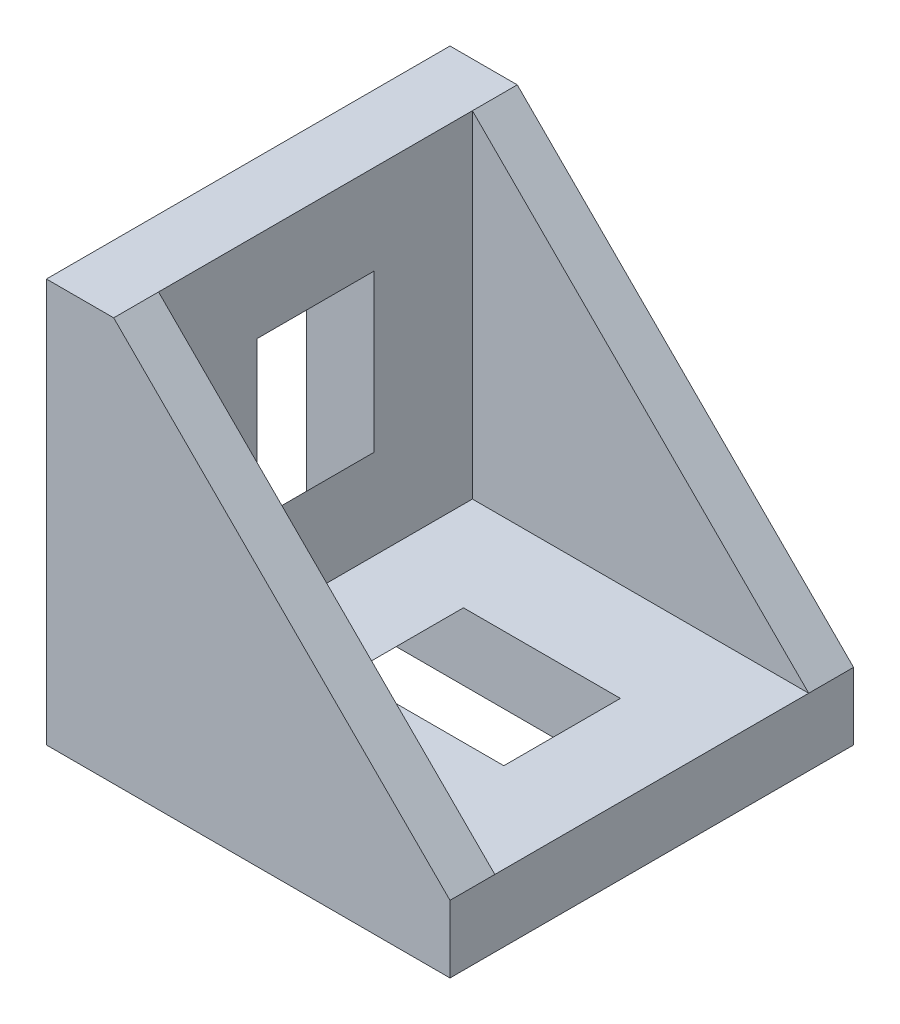
ISO-10303-21;
HEADER;
FILE_DESCRIPTION(('STEP AP214'),'2;1');
FILE_NAME('part.step','',(''),(''),'','','');
FILE_SCHEMA(('AUTOMOTIVE_DESIGN { 1 0 10303 214 1 1 1 1 }'));
ENDSEC;
DATA;
#1=APPLICATION_CONTEXT('core data for automotive mechanical design processes');
#2=APPLICATION_PROTOCOL_DEFINITION('international standard','automotive_design',2000,#1);
#3=PRODUCT_CONTEXT('',#1,'mechanical');
#4=PRODUCT('Part','Part','',(#3));
#5=PRODUCT_RELATED_PRODUCT_CATEGORY('part','',(#4));
#6=PRODUCT_DEFINITION_FORMATION('','',#4);
#7=PRODUCT_DEFINITION_CONTEXT('part definition',#1,'design');
#8=PRODUCT_DEFINITION('design','',#6,#7);
#9=PRODUCT_DEFINITION_SHAPE('','',#8);
#10=(LENGTH_UNIT() NAMED_UNIT(*) SI_UNIT(.MILLI.,.METRE.));
#11=(NAMED_UNIT(*) PLANE_ANGLE_UNIT() SI_UNIT($,.RADIAN.));
#12=(NAMED_UNIT(*) SI_UNIT($,.STERADIAN.) SOLID_ANGLE_UNIT());
#13=UNCERTAINTY_MEASURE_WITH_UNIT(LENGTH_MEASURE(1.E-05),#10,'distance_accuracy_value','');
#14=(GEOMETRIC_REPRESENTATION_CONTEXT(3) GLOBAL_UNCERTAINTY_ASSIGNED_CONTEXT((#13)) GLOBAL_UNIT_ASSIGNED_CONTEXT((#10,
#11,#12)) REPRESENTATION_CONTEXT('',''));
#15=CARTESIAN_POINT('',(0.,0.,0.));
#16=DIRECTION('',(0.,0.,1.));
#17=DIRECTION('',(1.,0.,0.));
#18=AXIS2_PLACEMENT_3D('',#15,#16,#17);
#19=CARTESIAN_POINT('',(0.,0.,9.));
#20=DIRECTION('',(1.,0.,0.));
#21=DIRECTION('',(0.,0.,-1.));
#22=AXIS2_PLACEMENT_3D('',#19,#20,#21);
#23=PLANE('',#22);
#24=DIRECTION('',(0.,0.,-1.));
#25=VECTOR('',#24,1.);
#26=CARTESIAN_POINT('',(0.,17.3,3.));
#27=LINE('',#26,#25);
#28=CARTESIAN_POINT('',(0.,17.3,3.));
#29=VERTEX_POINT('',#28);
#30=CARTESIAN_POINT('',(0.,17.3,-3.));
#31=VERTEX_POINT('',#30);
#32=EDGE_CURVE('E290',#29,#31,#27,.T.);
#33=ORIENTED_EDGE('',*,*,#32,.F.);
#34=DIRECTION('',(0.,1.,0.));
#35=VECTOR('',#34,1.);
#36=CARTESIAN_POINT('',(0.,17.3,3.));
#37=LINE('',#36,#35);
#38=CARTESIAN_POINT('',(0.,14.9992165715514,3.));
#39=VERTEX_POINT('',#38);
#40=EDGE_CURVE('E287',#39,#29,#37,.T.);
#41=ORIENTED_EDGE('',*,*,#40,.F.);
#42=DIRECTION('',(0.,0.,-1.));
#43=VECTOR('',#42,1.);
#44=CARTESIAN_POINT('',(0.,14.9992165715514,3.));
#45=LINE('',#44,#43);
#46=CARTESIAN_POINT('',(0.,14.9992165715514,-3.));
#47=VERTEX_POINT('',#46);
#48=EDGE_CURVE('E301',#39,#47,#45,.T.);
#49=ORIENTED_EDGE('',*,*,#48,.T.);
#50=DIRECTION('',(0.,1.,0.));
#51=VECTOR('',#50,1.);
#52=CARTESIAN_POINT('',(0.,17.3,-3.));
#53=LINE('',#52,#51);
#54=EDGE_CURVE('E282',#47,#31,#53,.T.);
#55=ORIENTED_EDGE('',*,*,#54,.T.);
#56=EDGE_LOOP('',(#33,#41,#49,#55));
#57=FACE_BOUND('',#56,.T.);
#58=DIRECTION('',(0.,-1.,0.));
#59=VECTOR('',#58,1.);
#60=CARTESIAN_POINT('',(0.,14.,-2.6));
#61=LINE('',#60,#59);
#62=CARTESIAN_POINT('',(0.,14.,-2.6));
#63=VERTEX_POINT('',#62);
#64=CARTESIAN_POINT('',(0.,4.,-2.6));
#65=VERTEX_POINT('',#64);
#66=EDGE_CURVE('E404',#63,#65,#61,.T.);
#67=ORIENTED_EDGE('',*,*,#66,.F.);
#68=DIRECTION('',(0.,0.,1.));
#69=VECTOR('',#68,1.);
#70=CARTESIAN_POINT('',(0.,14.,-2.6));
#71=LINE('',#70,#69);
#72=CARTESIAN_POINT('',(0.,14.,2.6));
#73=VERTEX_POINT('',#72);
#74=EDGE_CURVE('E427',#63,#73,#71,.T.);
#75=ORIENTED_EDGE('',*,*,#74,.T.);
#76=DIRECTION('',(0.,-1.,0.));
#77=VECTOR('',#76,1.);
#78=CARTESIAN_POINT('',(0.,14.,2.6));
#79=LINE('',#78,#77);
#80=CARTESIAN_POINT('',(0.,4.,2.6));
#81=VERTEX_POINT('',#80);
#82=EDGE_CURVE('E395',#73,#81,#79,.T.);
#83=ORIENTED_EDGE('',*,*,#82,.T.);
#84=DIRECTION('',(0.,0.,1.));
#85=VECTOR('',#84,1.);
#86=CARTESIAN_POINT('',(0.,4.,-2.6));
#87=LINE('',#86,#85);
#88=EDGE_CURVE('E416',#65,#81,#87,.T.);
#89=ORIENTED_EDGE('',*,*,#88,.F.);
#90=EDGE_LOOP('',(#67,#75,#83,#89));
#91=FACE_BOUND('',#90,.T.);
#92=DIRECTION('',(0.,-1.,0.));
#93=VECTOR('',#92,1.);
#94=CARTESIAN_POINT('',(0.,0.,-9.));
#95=LINE('',#94,#93);
#96=CARTESIAN_POINT('',(0.,18.,-9.));
#97=VERTEX_POINT('',#96);
#98=CARTESIAN_POINT('',(0.,0.,-9.));
#99=VERTEX_POINT('',#98);
#100=EDGE_CURVE('E467',#97,#99,#95,.T.);
#101=ORIENTED_EDGE('',*,*,#100,.T.);
#102=DIRECTION('',(0.,0.,-1.));
#103=VECTOR('',#102,1.);
#104=CARTESIAN_POINT('',(0.,0.,9.));
#105=LINE('',#104,#103);
#106=CARTESIAN_POINT('',(0.,0.,9.));
#107=VERTEX_POINT('',#106);
#108=EDGE_CURVE('E475',#107,#99,#105,.T.);
#109=ORIENTED_EDGE('',*,*,#108,.F.);
#110=DIRECTION('',(0.,-1.,0.));
#111=VECTOR('',#110,1.);
#112=CARTESIAN_POINT('',(0.,0.,9.));
#113=LINE('',#112,#111);
#114=CARTESIAN_POINT('',(0.,18.,9.));
#115=VERTEX_POINT('',#114);
#116=EDGE_CURVE('E473',#115,#107,#113,.T.);
#117=ORIENTED_EDGE('',*,*,#116,.F.);
#118=DIRECTION('',(0.,0.,-1.));
#119=VECTOR('',#118,1.);
#120=CARTESIAN_POINT('',(0.,18.,9.));
#121=LINE('',#120,#119);
#122=EDGE_CURVE('E489',#115,#97,#121,.T.);
#123=ORIENTED_EDGE('',*,*,#122,.T.);
#124=EDGE_LOOP('',(#101,#109,#117,#123));
#125=FACE_BOUND('',#124,.T.);
#126=DIRECTION('',(0.,1.,0.));
#127=VECTOR('',#126,1.);
#128=CARTESIAN_POINT('',(0.,1.23475047748415,3.));
#129=LINE('',#128,#127);
#130=CARTESIAN_POINT('',(0.,1.23475047748415,3.));
#131=VERTEX_POINT('',#130);
#132=CARTESIAN_POINT('',(0.,3.53553390593273,3.));
#133=VERTEX_POINT('',#132);
#134=EDGE_CURVE('E310',#131,#133,#129,.T.);
#135=ORIENTED_EDGE('',*,*,#134,.F.);
#136=DIRECTION('',(0.,0.,-1.));
#137=VECTOR('',#136,1.);
#138=CARTESIAN_POINT('',(0.,1.23475047748415,3.));
#139=LINE('',#138,#137);
#140=CARTESIAN_POINT('',(0.,1.23475047748415,-3.));
#141=VERTEX_POINT('',#140);
#142=EDGE_CURVE('E320',#131,#141,#139,.T.);
#143=ORIENTED_EDGE('',*,*,#142,.T.);
#144=DIRECTION('',(0.,1.,0.));
#145=VECTOR('',#144,1.);
#146=CARTESIAN_POINT('',(0.,1.23475047748415,-3.));
#147=LINE('',#146,#145);
#148=CARTESIAN_POINT('',(0.,3.53553390593273,-3.));
#149=VERTEX_POINT('',#148);
#150=EDGE_CURVE('E309',#141,#149,#147,.T.);
#151=ORIENTED_EDGE('',*,*,#150,.T.);
#152=DIRECTION('',(0.,0.,-1.));
#153=VECTOR('',#152,1.);
#154=CARTESIAN_POINT('',(0.,3.53553390593273,3.));
#155=LINE('',#154,#153);
#156=EDGE_CURVE('E336',#133,#149,#155,.T.);
#157=ORIENTED_EDGE('',*,*,#156,.F.);
#158=EDGE_LOOP('',(#135,#143,#151,#157));
#159=FACE_BOUND('',#158,.T.);
#160=ADVANCED_FACE('F34',(#57,#91,#125,#159),#23,.F.);
#161=CARTESIAN_POINT('',(18.,0.,9.));
#162=DIRECTION('',(0.,1.,0.));
#163=DIRECTION('',(-1.,0.,0.));
#164=AXIS2_PLACEMENT_3D('',#161,#162,#163);
#165=PLANE('',#164);
#166=DIRECTION('',(0.,0.,-1.));
#167=VECTOR('',#166,1.);
#168=CARTESIAN_POINT('',(14.9992165715514,0.,3.));
#169=LINE('',#168,#167);
#170=CARTESIAN_POINT('',(14.9992165715514,0.,3.));
#171=VERTEX_POINT('',#170);
#172=CARTESIAN_POINT('',(14.9992165715514,0.,-3.));
#173=VERTEX_POINT('',#172);
#174=EDGE_CURVE('E49',#171,#173,#169,.T.);
#175=ORIENTED_EDGE('',*,*,#174,.F.);
#176=DIRECTION('',(-1.,0.,0.));
#177=VECTOR('',#176,1.);
#178=CARTESIAN_POINT('',(17.3,0.,3.));
#179=LINE('',#178,#177);
#180=CARTESIAN_POINT('',(17.3,0.,3.));
#181=VERTEX_POINT('',#180);
#182=EDGE_CURVE('E54',#181,#171,#179,.T.);
#183=ORIENTED_EDGE('',*,*,#182,.F.);
#184=DIRECTION('',(0.,0.,-1.));
#185=VECTOR('',#184,1.);
#186=CARTESIAN_POINT('',(17.3,0.,3.));
#187=LINE('',#186,#185);
#188=CARTESIAN_POINT('',(17.3,0.,-3.));
#189=VERTEX_POINT('',#188);
#190=EDGE_CURVE('E262',#181,#189,#187,.T.);
#191=ORIENTED_EDGE('',*,*,#190,.T.);
#192=DIRECTION('',(-1.,0.,0.));
#193=VECTOR('',#192,1.);
#194=CARTESIAN_POINT('',(17.3,0.,-3.));
#195=LINE('',#194,#193);
#196=EDGE_CURVE('E266',#189,#173,#195,.T.);
#197=ORIENTED_EDGE('',*,*,#196,.T.);
#198=EDGE_LOOP('',(#175,#183,#191,#197));
#199=FACE_BOUND('',#198,.T.);
#200=DIRECTION('',(1.,0.,0.));
#201=VECTOR('',#200,1.);
#202=CARTESIAN_POINT('',(4.,0.,-2.6));
#203=LINE('',#202,#201);
#204=CARTESIAN_POINT('',(4.,0.,-2.6));
#205=VERTEX_POINT('',#204);
#206=CARTESIAN_POINT('',(14.,0.,-2.6));
#207=VERTEX_POINT('',#206);
#208=EDGE_CURVE('E372',#205,#207,#203,.T.);
#209=ORIENTED_EDGE('',*,*,#208,.F.);
#210=DIRECTION('',(0.,0.,1.));
#211=VECTOR('',#210,1.);
#212=CARTESIAN_POINT('',(4.,0.,-2.6));
#213=LINE('',#212,#211);
#214=CARTESIAN_POINT('',(4.,0.,2.6));
#215=VERTEX_POINT('',#214);
#216=EDGE_CURVE('E382',#205,#215,#213,.T.);
#217=ORIENTED_EDGE('',*,*,#216,.T.);
#218=DIRECTION('',(1.,0.,0.));
#219=VECTOR('',#218,1.);
#220=CARTESIAN_POINT('',(4.,0.,2.6));
#221=LINE('',#220,#219);
#222=CARTESIAN_POINT('',(14.,0.,2.6));
#223=VERTEX_POINT('',#222);
#224=EDGE_CURVE('E385',#215,#223,#221,.T.);
#225=ORIENTED_EDGE('',*,*,#224,.T.);
#226=DIRECTION('',(0.,0.,1.));
#227=VECTOR('',#226,1.);
#228=CARTESIAN_POINT('',(14.,0.,-2.6));
#229=LINE('',#228,#227);
#230=EDGE_CURVE('E399',#207,#223,#229,.T.);
#231=ORIENTED_EDGE('',*,*,#230,.F.);
#232=EDGE_LOOP('',(#209,#217,#225,#231));
#233=FACE_BOUND('',#232,.T.);
#234=DIRECTION('',(1.,0.,0.));
#235=VECTOR('',#234,1.);
#236=CARTESIAN_POINT('',(18.,0.,-9.));
#237=LINE('',#236,#235);
#238=CARTESIAN_POINT('',(18.,0.,-9.));
#239=VERTEX_POINT('',#238);
#240=EDGE_CURVE('E459',#99,#239,#237,.T.);
#241=ORIENTED_EDGE('',*,*,#240,.T.);
#242=DIRECTION('',(0.,0.,-1.));
#243=VECTOR('',#242,1.);
#244=CARTESIAN_POINT('',(18.,0.,9.));
#245=LINE('',#244,#243);
#246=CARTESIAN_POINT('',(18.,0.,9.));
#247=VERTEX_POINT('',#246);
#248=EDGE_CURVE('E11',#247,#239,#245,.T.);
#249=ORIENTED_EDGE('',*,*,#248,.F.);
#250=DIRECTION('',(1.,0.,0.));
#251=VECTOR('',#250,1.);
#252=CARTESIAN_POINT('',(18.,0.,9.));
#253=LINE('',#252,#251);
#254=EDGE_CURVE('E463',#107,#247,#253,.T.);
#255=ORIENTED_EDGE('',*,*,#254,.F.);
#256=ORIENTED_EDGE('',*,*,#108,.T.);
#257=EDGE_LOOP('',(#241,#249,#255,#256));
#258=FACE_BOUND('',#257,.T.);
#259=DIRECTION('',(-1.,0.,0.));
#260=VECTOR('',#259,1.);
#261=CARTESIAN_POINT('',(1.23475047748409,0.,3.));
#262=LINE('',#261,#260);
#263=CARTESIAN_POINT('',(3.53553390593274,0.,3.));
#264=VERTEX_POINT('',#263);
#265=CARTESIAN_POINT('',(1.23475047748409,0.,3.));
#266=VERTEX_POINT('',#265);
#267=EDGE_CURVE('E341',#264,#266,#262,.T.);
#268=ORIENTED_EDGE('',*,*,#267,.F.);
#269=DIRECTION('',(0.,0.,-1.));
#270=VECTOR('',#269,1.);
#271=CARTESIAN_POINT('',(3.53553390593274,0.,3.));
#272=LINE('',#271,#270);
#273=CARTESIAN_POINT('',(3.53553390593274,0.,-3.));
#274=VERTEX_POINT('',#273);
#275=EDGE_CURVE('E365',#264,#274,#272,.T.);
#276=ORIENTED_EDGE('',*,*,#275,.T.);
#277=DIRECTION('',(-1.,0.,0.));
#278=VECTOR('',#277,1.);
#279=CARTESIAN_POINT('',(1.23475047748409,0.,-3.));
#280=LINE('',#279,#278);
#281=CARTESIAN_POINT('',(1.23475047748409,0.,-3.));
#282=VERTEX_POINT('',#281);
#283=EDGE_CURVE('E351',#274,#282,#280,.T.);
#284=ORIENTED_EDGE('',*,*,#283,.T.);
#285=DIRECTION('',(0.,0.,-1.));
#286=VECTOR('',#285,1.);
#287=CARTESIAN_POINT('',(1.23475047748409,0.,3.));
#288=LINE('',#287,#286);
#289=EDGE_CURVE('E362',#266,#282,#288,.T.);
#290=ORIENTED_EDGE('',*,*,#289,.F.);
#291=EDGE_LOOP('',(#268,#276,#284,#290));
#292=FACE_BOUND('',#291,.T.);
#293=ADVANCED_FACE('F36',(#199,#233,#258,#292),#165,.F.);
#294=CARTESIAN_POINT('',(3.,3.,-7.));
#295=DIRECTION('',(0.,-1.,0.));
#296=DIRECTION('',(0.,0.,-1.));
#297=AXIS2_PLACEMENT_3D('',#294,#295,#296);
#298=PLANE('',#297);
#299=DIRECTION('',(1.,0.,0.));
#300=VECTOR('',#299,1.);
#301=CARTESIAN_POINT('',(3.,3.,7.));
#302=LINE('',#301,#300);
#303=CARTESIAN_POINT('',(3.,3.,7.));
#304=VERTEX_POINT('',#303);
#305=CARTESIAN_POINT('',(18.,3.,7.));
#306=VERTEX_POINT('',#305);
#307=EDGE_CURVE('E442',#304,#306,#302,.T.);
#308=ORIENTED_EDGE('',*,*,#307,.T.);
#309=DIRECTION('',(0.,0.,1.));
#310=VECTOR('',#309,1.);
#311=CARTESIAN_POINT('',(18.,3.,-7.));
#312=LINE('',#311,#310);
#313=CARTESIAN_POINT('',(18.,3.,-7.));
#314=VERTEX_POINT('',#313);
#315=EDGE_CURVE('E456',#314,#306,#312,.T.);
#316=ORIENTED_EDGE('',*,*,#315,.F.);
#317=DIRECTION('',(1.,0.,0.));
#318=VECTOR('',#317,1.);
#319=CARTESIAN_POINT('',(3.,3.,-7.));
#320=LINE('',#319,#318);
#321=CARTESIAN_POINT('',(3.,3.,-7.));
#322=VERTEX_POINT('',#321);
#323=EDGE_CURVE('E445',#322,#314,#320,.T.);
#324=ORIENTED_EDGE('',*,*,#323,.F.);
#325=DIRECTION('',(0.,0.,1.));
#326=VECTOR('',#325,1.);
#327=CARTESIAN_POINT('',(3.,3.,-7.));
#328=LINE('',#327,#326);
#329=EDGE_CURVE('E460',#322,#304,#328,.T.);
#330=ORIENTED_EDGE('',*,*,#329,.T.);
#331=EDGE_LOOP('',(#308,#316,#324,#330));
#332=FACE_BOUND('',#331,.T.);
#333=DIRECTION('',(-1.,0.,0.));
#334=VECTOR('',#333,1.);
#335=CARTESIAN_POINT('',(7.,3.,-2.6));
#336=LINE('',#335,#334);
#337=CARTESIAN_POINT('',(14.,3.,-2.6));
#338=VERTEX_POINT('',#337);
#339=CARTESIAN_POINT('',(7.,3.,-2.6));
#340=VERTEX_POINT('',#339);
#341=EDGE_CURVE('E379',#338,#340,#336,.T.);
#342=ORIENTED_EDGE('',*,*,#341,.F.);
#343=DIRECTION('',(0.,0.,1.));
#344=VECTOR('',#343,1.);
#345=CARTESIAN_POINT('',(14.,3.,-2.6));
#346=LINE('',#345,#344);
#347=CARTESIAN_POINT('',(14.,3.,2.6));
#348=VERTEX_POINT('',#347);
#349=EDGE_CURVE('E396',#338,#348,#346,.T.);
#350=ORIENTED_EDGE('',*,*,#349,.T.);
#351=DIRECTION('',(-1.,0.,0.));
#352=VECTOR('',#351,1.);
#353=CARTESIAN_POINT('',(7.,3.,2.6));
#354=LINE('',#353,#352);
#355=CARTESIAN_POINT('',(7.,3.,2.6));
#356=VERTEX_POINT('',#355);
#357=EDGE_CURVE('E373',#348,#356,#354,.T.);
#358=ORIENTED_EDGE('',*,*,#357,.T.);
#359=DIRECTION('',(0.,0.,1.));
#360=VECTOR('',#359,1.);
#361=CARTESIAN_POINT('',(7.,3.,-2.6));
#362=LINE('',#361,#360);
#363=EDGE_CURVE('E392',#340,#356,#362,.T.);
#364=ORIENTED_EDGE('',*,*,#363,.F.);
#365=EDGE_LOOP('',(#342,#350,#358,#364));
#366=FACE_BOUND('',#365,.T.);
#367=ADVANCED_FACE('F533',(#332,#366),#298,.F.);
#368=CARTESIAN_POINT('',(3.,18.,-7.));
#369=DIRECTION('',(-1.,0.,0.));
#370=DIRECTION('',(0.,-1.,0.));
#371=AXIS2_PLACEMENT_3D('',#368,#369,#370);
#372=PLANE('',#371);
#373=DIRECTION('',(0.,-1.,0.));
#374=VECTOR('',#373,1.);
#375=CARTESIAN_POINT('',(3.,18.,7.));
#376=LINE('',#375,#374);
#377=CARTESIAN_POINT('',(3.,18.,7.));
#378=VERTEX_POINT('',#377);
#379=EDGE_CURVE('E451',#378,#304,#376,.T.);
#380=ORIENTED_EDGE('',*,*,#379,.T.);
#381=ORIENTED_EDGE('',*,*,#329,.F.);
#382=DIRECTION('',(0.,-1.,0.));
#383=VECTOR('',#382,1.);
#384=CARTESIAN_POINT('',(3.,18.,-7.));
#385=LINE('',#384,#383);
#386=CARTESIAN_POINT('',(3.,18.,-7.));
#387=VERTEX_POINT('',#386);
#388=EDGE_CURVE('E441',#387,#322,#385,.T.);
#389=ORIENTED_EDGE('',*,*,#388,.F.);
#390=DIRECTION('',(0.,0.,1.));
#391=VECTOR('',#390,1.);
#392=CARTESIAN_POINT('',(3.,18.,-7.));
#393=LINE('',#392,#391);
#394=EDGE_CURVE('E448',#387,#378,#393,.T.);
#395=ORIENTED_EDGE('',*,*,#394,.T.);
#396=EDGE_LOOP('',(#380,#381,#389,#395));
#397=FACE_BOUND('',#396,.T.);
#398=DIRECTION('',(0.,1.,0.));
#399=VECTOR('',#398,1.);
#400=CARTESIAN_POINT('',(3.,14.,-2.6));
#401=LINE('',#400,#399);
#402=CARTESIAN_POINT('',(3.,7.,-2.6));
#403=VERTEX_POINT('',#402);
#404=CARTESIAN_POINT('',(3.,14.,-2.6));
#405=VERTEX_POINT('',#404);
#406=EDGE_CURVE('E411',#403,#405,#401,.T.);
#407=ORIENTED_EDGE('',*,*,#406,.F.);
#408=DIRECTION('',(0.,0.,1.));
#409=VECTOR('',#408,1.);
#410=CARTESIAN_POINT('',(3.,7.,-2.6));
#411=LINE('',#410,#409);
#412=CARTESIAN_POINT('',(3.,7.,2.6));
#413=VERTEX_POINT('',#412);
#414=EDGE_CURVE('E434',#403,#413,#411,.T.);
#415=ORIENTED_EDGE('',*,*,#414,.T.);
#416=DIRECTION('',(0.,1.,0.));
#417=VECTOR('',#416,1.);
#418=CARTESIAN_POINT('',(3.,14.,2.6));
#419=LINE('',#418,#417);
#420=CARTESIAN_POINT('',(3.,14.,2.6));
#421=VERTEX_POINT('',#420);
#422=EDGE_CURVE('E422',#413,#421,#419,.T.);
#423=ORIENTED_EDGE('',*,*,#422,.T.);
#424=DIRECTION('',(0.,0.,1.));
#425=VECTOR('',#424,1.);
#426=CARTESIAN_POINT('',(3.,14.,-2.6));
#427=LINE('',#426,#425);
#428=EDGE_CURVE('E431',#405,#421,#427,.T.);
#429=ORIENTED_EDGE('',*,*,#428,.F.);
#430=EDGE_LOOP('',(#407,#415,#423,#429));
#431=FACE_BOUND('',#430,.T.);
#432=ADVANCED_FACE('F538',(#397,#431),#372,.F.);
#433=CARTESIAN_POINT('',(18.,3.,9.));
#434=DIRECTION('',(-0.707106781186547,-0.707106781186547,0.));
#435=DIRECTION('',(0.707106781186548,-0.707106781186548,0.));
#436=AXIS2_PLACEMENT_3D('',#433,#434,#435);
#437=PLANE('',#436);
#438=DIRECTION('',(-0.707106781186547,0.707106781186547,0.));
#439=VECTOR('',#438,1.);
#440=CARTESIAN_POINT('',(3.,18.,-7.));
#441=LINE('',#440,#439);
#442=EDGE_CURVE('E439',#314,#387,#441,.T.);
#443=ORIENTED_EDGE('',*,*,#442,.F.);
#444=DIRECTION('',(0.,0.,-1.));
#445=VECTOR('',#444,1.);
#446=CARTESIAN_POINT('',(18.,3.,9.));
#447=LINE('',#446,#445);
#448=CARTESIAN_POINT('',(18.,3.,-9.));
#449=VERTEX_POINT('',#448);
#450=EDGE_CURVE('E495',#314,#449,#447,.T.);
#451=ORIENTED_EDGE('',*,*,#450,.T.);
#452=DIRECTION('',(-0.707106781186547,0.707106781186547,0.));
#453=VECTOR('',#452,1.);
#454=CARTESIAN_POINT('',(18.,3.,-9.));
#455=LINE('',#454,#453);
#456=CARTESIAN_POINT('',(3.,18.,-9.));
#457=VERTEX_POINT('',#456);
#458=EDGE_CURVE('E481',#449,#457,#455,.T.);
#459=ORIENTED_EDGE('',*,*,#458,.T.);
#460=DIRECTION('',(0.,0.,-1.));
#461=VECTOR('',#460,1.);
#462=CARTESIAN_POINT('',(3.,18.,9.));
#463=LINE('',#462,#461);
#464=EDGE_CURVE('E492',#387,#457,#463,.T.);
#465=ORIENTED_EDGE('',*,*,#464,.F.);
#466=EDGE_LOOP('',(#443,#451,#459,#465));
#467=FACE_BOUND('',#466,.T.);
#468=ADVANCED_FACE('F503',(#467),#437,.F.);
#469=CARTESIAN_POINT('',(18.,3.,9.));
#470=DIRECTION('',(-1.,0.,0.));
#471=DIRECTION('',(0.,0.,1.));
#472=AXIS2_PLACEMENT_3D('',#469,#470,#471);
#473=PLANE('',#472);
#474=DIRECTION('',(0.,1.,0.));
#475=VECTOR('',#474,1.);
#476=CARTESIAN_POINT('',(18.,3.,-9.));
#477=LINE('',#476,#475);
#478=EDGE_CURVE('E478',#239,#449,#477,.T.);
#479=ORIENTED_EDGE('',*,*,#478,.T.);
#480=ORIENTED_EDGE('',*,*,#450,.F.);
#481=ORIENTED_EDGE('',*,*,#315,.T.);
#482=CARTESIAN_POINT('',(18.,3.,9.));
#483=VERTEX_POINT('',#482);
#484=EDGE_CURVE('E42',#483,#306,#447,.T.);
#485=ORIENTED_EDGE('',*,*,#484,.F.);
#486=DIRECTION('',(0.,1.,0.));
#487=VECTOR('',#486,1.);
#488=CARTESIAN_POINT('',(18.,3.,9.));
#489=LINE('',#488,#487);
#490=EDGE_CURVE('E466',#247,#483,#489,.T.);
#491=ORIENTED_EDGE('',*,*,#490,.F.);
#492=ORIENTED_EDGE('',*,*,#248,.T.);
#493=EDGE_LOOP('',(#479,#480,#481,#485,#491,#492));
#494=FACE_BOUND('',#493,.T.);
#495=ADVANCED_FACE('F508',(#494),#473,.F.);
#496=ORIENTED_EDGE('',*,*,#484,.T.);
#497=DIRECTION('',(-0.707106781186547,0.707106781186547,0.));
#498=VECTOR('',#497,1.);
#499=CARTESIAN_POINT('',(3.,18.,7.));
#500=LINE('',#499,#498);
#501=EDGE_CURVE('E430',#306,#378,#500,.T.);
#502=ORIENTED_EDGE('',*,*,#501,.T.);
#503=CARTESIAN_POINT('',(3.,18.,9.));
#504=VERTEX_POINT('',#503);
#505=EDGE_CURVE('E493',#504,#378,#463,.T.);
#506=ORIENTED_EDGE('',*,*,#505,.F.);
#507=DIRECTION('',(-0.707106781186547,0.707106781186547,0.));
#508=VECTOR('',#507,1.);
#509=CARTESIAN_POINT('',(18.,3.,9.));
#510=LINE('',#509,#508);
#511=EDGE_CURVE('E469',#483,#504,#510,.T.);
#512=ORIENTED_EDGE('',*,*,#511,.F.);
#513=EDGE_LOOP('',(#496,#502,#506,#512));
#514=FACE_BOUND('',#513,.T.);
#515=ADVANCED_FACE('F527',(#514),#437,.F.);
#516=CARTESIAN_POINT('',(3.,18.,9.));
#517=DIRECTION('',(0.,-1.,0.));
#518=DIRECTION('',(0.,0.,-1.));
#519=AXIS2_PLACEMENT_3D('',#516,#517,#518);
#520=PLANE('',#519);
#521=DIRECTION('',(-1.,0.,0.));
#522=VECTOR('',#521,1.);
#523=CARTESIAN_POINT('',(3.,18.,-9.));
#524=LINE('',#523,#522);
#525=EDGE_CURVE('E484',#457,#97,#524,.T.);
#526=ORIENTED_EDGE('',*,*,#525,.T.);
#527=ORIENTED_EDGE('',*,*,#122,.F.);
#528=DIRECTION('',(-1.,0.,0.));
#529=VECTOR('',#528,1.);
#530=CARTESIAN_POINT('',(3.,18.,9.));
#531=LINE('',#530,#529);
#532=EDGE_CURVE('E471',#504,#115,#531,.T.);
#533=ORIENTED_EDGE('',*,*,#532,.F.);
#534=ORIENTED_EDGE('',*,*,#505,.T.);
#535=ORIENTED_EDGE('',*,*,#394,.F.);
#536=ORIENTED_EDGE('',*,*,#464,.T.);
#537=EDGE_LOOP('',(#526,#527,#533,#534,#535,#536));
#538=FACE_BOUND('',#537,.T.);
#539=ADVANCED_FACE('F516',(#538),#520,.F.);
#540=CARTESIAN_POINT('',(0.,0.,9.));
#541=DIRECTION('',(0.,0.,-1.));
#542=DIRECTION('',(-1.,0.,0.));
#543=AXIS2_PLACEMENT_3D('',#540,#541,#542);
#544=PLANE('',#543);
#545=ORIENTED_EDGE('',*,*,#254,.T.);
#546=ORIENTED_EDGE('',*,*,#490,.T.);
#547=ORIENTED_EDGE('',*,*,#511,.T.);
#548=ORIENTED_EDGE('',*,*,#532,.T.);
#549=ORIENTED_EDGE('',*,*,#116,.T.);
#550=EDGE_LOOP('',(#545,#546,#547,#548,#549));
#551=FACE_BOUND('',#550,.T.);
#552=ADVANCED_FACE('F525',(#551),#544,.F.);
#553=CARTESIAN_POINT('',(0.,0.,-9.));
#554=DIRECTION('',(0.,0.,-1.));
#555=DIRECTION('',(-1.,0.,0.));
#556=AXIS2_PLACEMENT_3D('',#553,#554,#555);
#557=PLANE('',#556);
#558=ORIENTED_EDGE('',*,*,#240,.F.);
#559=ORIENTED_EDGE('',*,*,#100,.F.);
#560=ORIENTED_EDGE('',*,*,#525,.F.);
#561=ORIENTED_EDGE('',*,*,#458,.F.);
#562=ORIENTED_EDGE('',*,*,#478,.F.);
#563=EDGE_LOOP('',(#558,#559,#560,#561,#562));
#564=FACE_BOUND('',#563,.T.);
#565=ADVANCED_FACE('F512',(#564),#557,.T.);
#566=CARTESIAN_POINT('',(18.,3.,-7.));
#567=DIRECTION('',(0.,0.,1.));
#568=DIRECTION('',(1.,0.,0.));
#569=AXIS2_PLACEMENT_3D('',#566,#567,#568);
#570=PLANE('',#569);
#571=ORIENTED_EDGE('',*,*,#442,.T.);
#572=ORIENTED_EDGE('',*,*,#388,.T.);
#573=ORIENTED_EDGE('',*,*,#323,.T.);
#574=EDGE_LOOP('',(#571,#572,#573));
#575=FACE_BOUND('',#574,.T.);
#576=ADVANCED_FACE('F541',(#575),#570,.T.);
#577=CARTESIAN_POINT('',(18.,3.,7.));
#578=DIRECTION('',(0.,0.,1.));
#579=DIRECTION('',(1.,0.,0.));
#580=AXIS2_PLACEMENT_3D('',#577,#578,#579);
#581=PLANE('',#580);
#582=ORIENTED_EDGE('',*,*,#501,.F.);
#583=ORIENTED_EDGE('',*,*,#307,.F.);
#584=ORIENTED_EDGE('',*,*,#379,.F.);
#585=EDGE_LOOP('',(#582,#583,#584));
#586=FACE_BOUND('',#585,.T.);
#587=ADVANCED_FACE('F531',(#586),#581,.F.);
#588=CARTESIAN_POINT('',(0.,14.,-2.6));
#589=DIRECTION('',(0.,1.,0.));
#590=DIRECTION('',(0.,0.,1.));
#591=AXIS2_PLACEMENT_3D('',#588,#589,#590);
#592=PLANE('',#591);
#593=DIRECTION('',(-1.,0.,0.));
#594=VECTOR('',#593,1.);
#595=CARTESIAN_POINT('',(0.,14.,2.6));
#596=LINE('',#595,#594);
#597=EDGE_CURVE('E408',#421,#73,#596,.T.);
#598=ORIENTED_EDGE('',*,*,#597,.T.);
#599=ORIENTED_EDGE('',*,*,#74,.F.);
#600=DIRECTION('',(-1.,0.,0.));
#601=VECTOR('',#600,1.);
#602=CARTESIAN_POINT('',(0.,14.,-2.6));
#603=LINE('',#602,#601);
#604=EDGE_CURVE('E413',#405,#63,#603,.T.);
#605=ORIENTED_EDGE('',*,*,#604,.F.);
#606=ORIENTED_EDGE('',*,*,#428,.T.);
#607=EDGE_LOOP('',(#598,#599,#605,#606));
#608=FACE_BOUND('',#607,.T.);
#609=ADVANCED_FACE('F548',(#608),#592,.F.);
#610=CARTESIAN_POINT('',(0.,4.,-2.6));
#611=DIRECTION('',(0.707106781186548,-0.707106781186547,0.));
#612=DIRECTION('',(0.707106781186547,0.707106781186548,0.));
#613=AXIS2_PLACEMENT_3D('',#610,#611,#612);
#614=PLANE('',#613);
#615=DIRECTION('',(0.707106781186547,0.707106781186548,0.));
#616=VECTOR('',#615,1.);
#617=CARTESIAN_POINT('',(0.,4.,2.6));
#618=LINE('',#617,#616);
#619=EDGE_CURVE('E419',#81,#413,#618,.T.);
#620=ORIENTED_EDGE('',*,*,#619,.T.);
#621=ORIENTED_EDGE('',*,*,#414,.F.);
#622=DIRECTION('',(0.707106781186547,0.707106781186548,0.));
#623=VECTOR('',#622,1.);
#624=CARTESIAN_POINT('',(0.,4.,-2.6));
#625=LINE('',#624,#623);
#626=EDGE_CURVE('E407',#65,#403,#625,.T.);
#627=ORIENTED_EDGE('',*,*,#626,.F.);
#628=ORIENTED_EDGE('',*,*,#88,.T.);
#629=EDGE_LOOP('',(#620,#621,#627,#628));
#630=FACE_BOUND('',#629,.T.);
#631=ADVANCED_FACE('F632',(#630),#614,.F.);
#632=CARTESIAN_POINT('',(0.,14.,-2.6));
#633=DIRECTION('',(0.,0.,1.));
#634=DIRECTION('',(1.,0.,0.));
#635=AXIS2_PLACEMENT_3D('',#632,#633,#634);
#636=PLANE('',#635);
#637=ORIENTED_EDGE('',*,*,#66,.T.);
#638=ORIENTED_EDGE('',*,*,#626,.T.);
#639=ORIENTED_EDGE('',*,*,#406,.T.);
#640=ORIENTED_EDGE('',*,*,#604,.T.);
#641=EDGE_LOOP('',(#637,#638,#639,#640));
#642=FACE_BOUND('',#641,.T.);
#643=ADVANCED_FACE('F642',(#642),#636,.T.);
#644=CARTESIAN_POINT('',(0.,14.,2.6));
#645=DIRECTION('',(0.,0.,1.));
#646=DIRECTION('',(1.,0.,0.));
#647=AXIS2_PLACEMENT_3D('',#644,#645,#646);
#648=PLANE('',#647);
#649=ORIENTED_EDGE('',*,*,#82,.F.);
#650=ORIENTED_EDGE('',*,*,#597,.F.);
#651=ORIENTED_EDGE('',*,*,#422,.F.);
#652=ORIENTED_EDGE('',*,*,#619,.F.);
#653=EDGE_LOOP('',(#649,#650,#651,#652));
#654=FACE_BOUND('',#653,.T.);
#655=ADVANCED_FACE('F651',(#654),#648,.F.);
#656=CARTESIAN_POINT('',(7.,3.,-2.6));
#657=DIRECTION('',(-0.707106781186548,0.707106781186547,0.));
#658=DIRECTION('',(-0.707106781186547,-0.707106781186548,0.));
#659=AXIS2_PLACEMENT_3D('',#656,#657,#658);
#660=PLANE('',#659);
#661=DIRECTION('',(-0.707106781186547,-0.707106781186548,0.));
#662=VECTOR('',#661,1.);
#663=CARTESIAN_POINT('',(7.,3.,2.6));
#664=LINE('',#663,#662);
#665=EDGE_CURVE('E368',#356,#215,#664,.T.);
#666=ORIENTED_EDGE('',*,*,#665,.T.);
#667=ORIENTED_EDGE('',*,*,#216,.F.);
#668=DIRECTION('',(-0.707106781186547,-0.707106781186548,0.));
#669=VECTOR('',#668,1.);
#670=CARTESIAN_POINT('',(7.,3.,-2.6));
#671=LINE('',#670,#669);
#672=EDGE_CURVE('E369',#340,#205,#671,.T.);
#673=ORIENTED_EDGE('',*,*,#672,.F.);
#674=ORIENTED_EDGE('',*,*,#363,.T.);
#675=EDGE_LOOP('',(#666,#667,#673,#674));
#676=FACE_BOUND('',#675,.T.);
#677=ADVANCED_FACE('F661',(#676),#660,.F.);
#678=CARTESIAN_POINT('',(14.,3.,-2.6));
#679=DIRECTION('',(1.,0.,0.));
#680=DIRECTION('',(0.,0.,-1.));
#681=AXIS2_PLACEMENT_3D('',#678,#679,#680);
#682=PLANE('',#681);
#683=DIRECTION('',(0.,1.,0.));
#684=VECTOR('',#683,1.);
#685=CARTESIAN_POINT('',(14.,3.,2.6));
#686=LINE('',#685,#684);
#687=EDGE_CURVE('E388',#223,#348,#686,.T.);
#688=ORIENTED_EDGE('',*,*,#687,.T.);
#689=ORIENTED_EDGE('',*,*,#349,.F.);
#690=DIRECTION('',(0.,1.,0.));
#691=VECTOR('',#690,1.);
#692=CARTESIAN_POINT('',(14.,3.,-2.6));
#693=LINE('',#692,#691);
#694=EDGE_CURVE('E376',#207,#338,#693,.T.);
#695=ORIENTED_EDGE('',*,*,#694,.F.);
#696=ORIENTED_EDGE('',*,*,#230,.T.);
#697=EDGE_LOOP('',(#688,#689,#695,#696));
#698=FACE_BOUND('',#697,.T.);
#699=ADVANCED_FACE('F671',(#698),#682,.F.);
#700=CARTESIAN_POINT('',(4.,0.,-2.6));
#701=DIRECTION('',(0.,0.,1.));
#702=DIRECTION('',(1.,0.,0.));
#703=AXIS2_PLACEMENT_3D('',#700,#701,#702);
#704=PLANE('',#703);
#705=ORIENTED_EDGE('',*,*,#672,.T.);
#706=ORIENTED_EDGE('',*,*,#208,.T.);
#707=ORIENTED_EDGE('',*,*,#694,.T.);
#708=ORIENTED_EDGE('',*,*,#341,.T.);
#709=EDGE_LOOP('',(#705,#706,#707,#708));
#710=FACE_BOUND('',#709,.T.);
#711=ADVANCED_FACE('F681',(#710),#704,.T.);
#712=CARTESIAN_POINT('',(4.,0.,2.6));
#713=DIRECTION('',(0.,0.,1.));
#714=DIRECTION('',(1.,0.,0.));
#715=AXIS2_PLACEMENT_3D('',#712,#713,#714);
#716=PLANE('',#715);
#717=ORIENTED_EDGE('',*,*,#665,.F.);
#718=ORIENTED_EDGE('',*,*,#357,.F.);
#719=ORIENTED_EDGE('',*,*,#687,.F.);
#720=ORIENTED_EDGE('',*,*,#224,.F.);
#721=EDGE_LOOP('',(#717,#718,#719,#720));
#722=FACE_BOUND('',#721,.T.);
#723=ADVANCED_FACE('F691',(#722),#716,.F.);
#724=CARTESIAN_POINT('',(3.53553390593274,0.,3.));
#725=DIRECTION('',(-0.663272861612094,0.748377652692077,0.));
#726=DIRECTION('',(-0.748377652692077,-0.663272861612095,0.));
#727=AXIS2_PLACEMENT_3D('',#724,#725,#726);
#728=PLANE('',#727);
#729=DIRECTION('',(0.748377652692077,0.663272861612094,0.));
#730=VECTOR('',#729,1.);
#731=CARTESIAN_POINT('',(3.53553390593274,0.,-3.));
#732=LINE('',#731,#730);
#733=CARTESIAN_POINT('',(1.49748336761072,-1.80628537984834,-3.));
#734=VERTEX_POINT('',#733);
#735=EDGE_CURVE('E338',#734,#274,#732,.T.);
#736=ORIENTED_EDGE('',*,*,#735,.T.);
#737=ORIENTED_EDGE('',*,*,#275,.F.);
#738=DIRECTION('',(0.748377652692077,0.663272861612094,0.));
#739=VECTOR('',#738,1.);
#740=CARTESIAN_POINT('',(3.53553390593274,0.,3.));
#741=LINE('',#740,#739);
#742=CARTESIAN_POINT('',(1.49748336761072,-1.80628537984834,3.));
#743=VERTEX_POINT('',#742);
#744=EDGE_CURVE('E339',#743,#264,#741,.T.);
#745=ORIENTED_EDGE('',*,*,#744,.F.);
#746=DIRECTION('',(0.,0.,-1.));
#747=VECTOR('',#746,1.);
#748=CARTESIAN_POINT('',(1.49748336761072,-1.80628537984834,3.));
#749=LINE('',#748,#747);
#750=EDGE_CURVE('E348',#743,#734,#749,.T.);
#751=ORIENTED_EDGE('',*,*,#750,.T.);
#752=EDGE_LOOP('',(#736,#737,#745,#751));
#753=FACE_BOUND('',#752,.T.);
#754=ADVANCED_FACE('F700',(#753),#728,.F.);
#755=CARTESIAN_POINT('',(0.504853676887192,-0.797938337342914,3.));
#756=DIRECTION('',(0.73786614945659,-0.674947068655094,0.));
#757=DIRECTION('',(0.674947068655094,0.73786614945659,0.));
#758=AXIS2_PLACEMENT_3D('',#755,#756,#757);
#759=PLANE('',#758);
#760=DIRECTION('',(-0.674947068655094,-0.737866149456591,0.));
#761=VECTOR('',#760,1.);
#762=CARTESIAN_POINT('',(0.504853676887192,-0.797938337342914,-3.));
#763=LINE('',#762,#761);
#764=CARTESIAN_POINT('',(0.504853676887192,-0.797938337342914,-3.));
#765=VERTEX_POINT('',#764);
#766=EDGE_CURVE('E354',#282,#765,#763,.T.);
#767=ORIENTED_EDGE('',*,*,#766,.T.);
#768=DIRECTION('',(0.,0.,-1.));
#769=VECTOR('',#768,1.);
#770=CARTESIAN_POINT('',(0.504853676887192,-0.797938337342914,3.));
#771=LINE('',#770,#769);
#772=CARTESIAN_POINT('',(0.504853676887192,-0.797938337342914,3.));
#773=VERTEX_POINT('',#772);
#774=EDGE_CURVE('E359',#773,#765,#771,.T.);
#775=ORIENTED_EDGE('',*,*,#774,.F.);
#776=DIRECTION('',(-0.674947068655094,-0.737866149456591,0.));
#777=VECTOR('',#776,1.);
#778=CARTESIAN_POINT('',(0.504853676887192,-0.797938337342914,3.));
#779=LINE('',#778,#777);
#780=EDGE_CURVE('E344',#266,#773,#779,.T.);
#781=ORIENTED_EDGE('',*,*,#780,.F.);
#782=ORIENTED_EDGE('',*,*,#289,.T.);
#783=EDGE_LOOP('',(#767,#775,#781,#782));
#784=FACE_BOUND('',#783,.T.);
#785=ADVANCED_FACE('F721',(#784),#759,.F.);
#786=CARTESIAN_POINT('',(1.49748336761072,-1.80628537984834,3.));
#787=DIRECTION('',(0.712639007666149,0.701530929291508,0.));
#788=DIRECTION('',(-0.701530929291508,0.712639007666149,0.));
#789=AXIS2_PLACEMENT_3D('',#786,#787,#788);
#790=PLANE('',#789);
#791=DIRECTION('',(0.701530929291508,-0.712639007666149,0.));
#792=VECTOR('',#791,1.);
#793=CARTESIAN_POINT('',(1.49748336761072,-1.80628537984834,-3.));
#794=LINE('',#793,#792);
#795=EDGE_CURVE('E342',#765,#734,#794,.T.);
#796=ORIENTED_EDGE('',*,*,#795,.T.);
#797=ORIENTED_EDGE('',*,*,#750,.F.);
#798=DIRECTION('',(0.701530929291508,-0.712639007666149,0.));
#799=VECTOR('',#798,1.);
#800=CARTESIAN_POINT('',(1.49748336761072,-1.80628537984834,3.));
#801=LINE('',#800,#799);
#802=EDGE_CURVE('E346',#773,#743,#801,.T.);
#803=ORIENTED_EDGE('',*,*,#802,.F.);
#804=ORIENTED_EDGE('',*,*,#774,.T.);
#805=EDGE_LOOP('',(#796,#797,#803,#804));
#806=FACE_BOUND('',#805,.T.);
#807=ADVANCED_FACE('F731',(#806),#790,.F.);
#808=CARTESIAN_POINT('',(1.49748336761072,-1.80628537984834,3.));
#809=DIRECTION('',(0.,0.,-1.));
#810=DIRECTION('',(-1.,0.,0.));
#811=AXIS2_PLACEMENT_3D('',#808,#809,#810);
#812=PLANE('',#811);
#813=ORIENTED_EDGE('',*,*,#744,.T.);
#814=ORIENTED_EDGE('',*,*,#267,.T.);
#815=ORIENTED_EDGE('',*,*,#780,.T.);
#816=ORIENTED_EDGE('',*,*,#802,.T.);
#817=EDGE_LOOP('',(#813,#814,#815,#816));
#818=FACE_BOUND('',#817,.T.);
#819=ADVANCED_FACE('F741',(#818),#812,.F.);
#820=CARTESIAN_POINT('',(1.49748336761072,-1.80628537984834,-3.));
#821=DIRECTION('',(0.,0.,-1.));
#822=DIRECTION('',(-1.,0.,0.));
#823=AXIS2_PLACEMENT_3D('',#820,#821,#822);
#824=PLANE('',#823);
#825=ORIENTED_EDGE('',*,*,#735,.F.);
#826=ORIENTED_EDGE('',*,*,#795,.F.);
#827=ORIENTED_EDGE('',*,*,#766,.F.);
#828=ORIENTED_EDGE('',*,*,#283,.F.);
#829=EDGE_LOOP('',(#825,#826,#827,#828));
#830=FACE_BOUND('',#829,.T.);
#831=ADVANCED_FACE('F751',(#830),#824,.T.);
#832=CARTESIAN_POINT('',(0.,3.53553390593273,3.));
#833=DIRECTION('',(0.748377652692076,-0.663272861612095,0.));
#834=DIRECTION('',(0.663272861612095,0.748377652692076,0.));
#835=AXIS2_PLACEMENT_3D('',#832,#833,#834);
#836=PLANE('',#835);
#837=DIRECTION('',(-0.663272861612095,-0.748377652692076,0.));
#838=VECTOR('',#837,1.);
#839=CARTESIAN_POINT('',(0.,3.53553390593273,-3.));
#840=LINE('',#839,#838);
#841=CARTESIAN_POINT('',(-1.80628537984834,1.49748336761072,-3.));
#842=VERTEX_POINT('',#841);
#843=EDGE_CURVE('E323',#149,#842,#840,.T.);
#844=ORIENTED_EDGE('',*,*,#843,.T.);
#845=DIRECTION('',(0.,0.,-1.));
#846=VECTOR('',#845,1.);
#847=CARTESIAN_POINT('',(-1.80628537984834,1.49748336761072,3.));
#848=LINE('',#847,#846);
#849=CARTESIAN_POINT('',(-1.80628537984834,1.49748336761072,3.));
#850=VERTEX_POINT('',#849);
#851=EDGE_CURVE('E333',#850,#842,#848,.T.);
#852=ORIENTED_EDGE('',*,*,#851,.F.);
#853=DIRECTION('',(-0.663272861612095,-0.748377652692076,0.));
#854=VECTOR('',#853,1.);
#855=CARTESIAN_POINT('',(0.,3.53553390593273,3.));
#856=LINE('',#855,#854);
#857=EDGE_CURVE('E313',#133,#850,#856,.T.);
#858=ORIENTED_EDGE('',*,*,#857,.F.);
#859=ORIENTED_EDGE('',*,*,#156,.T.);
#860=EDGE_LOOP('',(#844,#852,#858,#859));
#861=FACE_BOUND('',#860,.T.);
#862=ADVANCED_FACE('F761',(#861),#836,.F.);
#863=CARTESIAN_POINT('',(-1.80628537984834,1.49748336761072,3.));
#864=DIRECTION('',(0.701530929291508,0.712639007666149,0.));
#865=DIRECTION('',(-0.712639007666149,0.701530929291508,0.));
#866=AXIS2_PLACEMENT_3D('',#863,#864,#865);
#867=PLANE('',#866);
#868=DIRECTION('',(0.712639007666149,-0.701530929291508,0.));
#869=VECTOR('',#868,1.);
#870=CARTESIAN_POINT('',(-1.80628537984834,1.49748336761072,-3.));
#871=LINE('',#870,#869);
#872=CARTESIAN_POINT('',(-0.797938337342915,0.504853676887193,-3.));
#873=VERTEX_POINT('',#872);
#874=EDGE_CURVE('E325',#842,#873,#871,.T.);
#875=ORIENTED_EDGE('',*,*,#874,.T.);
#876=DIRECTION('',(0.,0.,-1.));
#877=VECTOR('',#876,1.);
#878=CARTESIAN_POINT('',(-0.797938337342915,0.504853676887193,3.));
#879=LINE('',#878,#877);
#880=CARTESIAN_POINT('',(-0.797938337342915,0.504853676887193,3.));
#881=VERTEX_POINT('',#880);
#882=EDGE_CURVE('E330',#881,#873,#879,.T.);
#883=ORIENTED_EDGE('',*,*,#882,.F.);
#884=DIRECTION('',(0.712639007666149,-0.701530929291508,0.));
#885=VECTOR('',#884,1.);
#886=CARTESIAN_POINT('',(-1.80628537984834,1.49748336761072,3.));
#887=LINE('',#886,#885);
#888=EDGE_CURVE('E316',#850,#881,#887,.T.);
#889=ORIENTED_EDGE('',*,*,#888,.F.);
#890=ORIENTED_EDGE('',*,*,#851,.T.);
#891=EDGE_LOOP('',(#875,#883,#889,#890));
#892=FACE_BOUND('',#891,.T.);
#893=ADVANCED_FACE('F771',(#892),#867,.F.);
#894=CARTESIAN_POINT('',(-0.797938337342915,0.504853676887193,3.));
#895=DIRECTION('',(-0.674947068655122,0.737866149456565,0.));
#896=DIRECTION('',(-0.737866149456565,-0.674947068655122,0.));
#897=AXIS2_PLACEMENT_3D('',#894,#895,#896);
#898=PLANE('',#897);
#899=DIRECTION('',(0.737866149456565,0.674947068655122,0.));
#900=VECTOR('',#899,1.);
#901=CARTESIAN_POINT('',(-0.797938337342915,0.504853676887193,-3.));
#902=LINE('',#901,#900);
#903=EDGE_CURVE('E314',#873,#141,#902,.T.);
#904=ORIENTED_EDGE('',*,*,#903,.T.);
#905=ORIENTED_EDGE('',*,*,#142,.F.);
#906=DIRECTION('',(0.737866149456565,0.674947068655122,0.));
#907=VECTOR('',#906,1.);
#908=CARTESIAN_POINT('',(-0.797938337342915,0.504853676887193,3.));
#909=LINE('',#908,#907);
#910=EDGE_CURVE('E318',#881,#131,#909,.T.);
#911=ORIENTED_EDGE('',*,*,#910,.F.);
#912=ORIENTED_EDGE('',*,*,#882,.T.);
#913=EDGE_LOOP('',(#904,#905,#911,#912));
#914=FACE_BOUND('',#913,.T.);
#915=ADVANCED_FACE('F781',(#914),#898,.F.);
#916=CARTESIAN_POINT('',(0.,1.23475047748415,3.));
#917=DIRECTION('',(0.,0.,-1.));
#918=DIRECTION('',(-1.,0.,0.));
#919=AXIS2_PLACEMENT_3D('',#916,#917,#918);
#920=PLANE('',#919);
#921=ORIENTED_EDGE('',*,*,#134,.T.);
#922=ORIENTED_EDGE('',*,*,#857,.T.);
#923=ORIENTED_EDGE('',*,*,#888,.T.);
#924=ORIENTED_EDGE('',*,*,#910,.T.);
#925=EDGE_LOOP('',(#921,#922,#923,#924));
#926=FACE_BOUND('',#925,.T.);
#927=ADVANCED_FACE('F791',(#926),#920,.F.);
#928=CARTESIAN_POINT('',(0.,1.23475047748415,-3.));
#929=DIRECTION('',(0.,0.,-1.));
#930=DIRECTION('',(-1.,0.,0.));
#931=AXIS2_PLACEMENT_3D('',#928,#929,#930);
#932=PLANE('',#931);
#933=ORIENTED_EDGE('',*,*,#150,.F.);
#934=ORIENTED_EDGE('',*,*,#903,.F.);
#935=ORIENTED_EDGE('',*,*,#874,.F.);
#936=ORIENTED_EDGE('',*,*,#843,.F.);
#937=EDGE_LOOP('',(#933,#934,#935,#936));
#938=FACE_BOUND('',#937,.T.);
#939=ADVANCED_FACE('F801',(#938),#932,.T.);
#940=CARTESIAN_POINT('',(-1.80628537984833,15.2619494616779,3.));
#941=DIRECTION('',(0.748377652692088,-0.663272861612082,0.));
#942=DIRECTION('',(0.663272861612082,0.748377652692088,0.));
#943=AXIS2_PLACEMENT_3D('',#940,#941,#942);
#944=PLANE('',#943);
#945=DIRECTION('',(-0.663272861612082,-0.748377652692088,0.));
#946=VECTOR('',#945,1.);
#947=CARTESIAN_POINT('',(-1.80628537984833,15.2619494616779,-3.));
#948=LINE('',#947,#946);
#949=CARTESIAN_POINT('',(-1.80628537984833,15.2619494616779,-3.));
#950=VERTEX_POINT('',#949);
#951=EDGE_CURVE('E277',#31,#950,#948,.T.);
#952=ORIENTED_EDGE('',*,*,#951,.T.);
#953=DIRECTION('',(0.,0.,-1.));
#954=VECTOR('',#953,1.);
#955=CARTESIAN_POINT('',(-1.80628537984833,15.2619494616779,3.));
#956=LINE('',#955,#954);
#957=CARTESIAN_POINT('',(-1.80628537984833,15.2619494616779,3.));
#958=VERTEX_POINT('',#957);
#959=EDGE_CURVE('E306',#958,#950,#956,.T.);
#960=ORIENTED_EDGE('',*,*,#959,.F.);
#961=DIRECTION('',(-0.663272861612082,-0.748377652692088,0.));
#962=VECTOR('',#961,1.);
#963=CARTESIAN_POINT('',(-1.80628537984833,15.2619494616779,3.));
#964=LINE('',#963,#962);
#965=EDGE_CURVE('E278',#29,#958,#964,.T.);
#966=ORIENTED_EDGE('',*,*,#965,.F.);
#967=ORIENTED_EDGE('',*,*,#32,.T.);
#968=EDGE_LOOP('',(#952,#960,#966,#967));
#969=FACE_BOUND('',#968,.T.);
#970=ADVANCED_FACE('F811',(#969),#944,.F.);
#971=CARTESIAN_POINT('',(-0.797938337342901,14.2693197709544,3.));
#972=DIRECTION('',(0.701530929291496,0.71263900766616,0.));
#973=DIRECTION('',(-0.71263900766616,0.701530929291496,0.));
#974=AXIS2_PLACEMENT_3D('',#971,#972,#973);
#975=PLANE('',#974);
#976=DIRECTION('',(0.71263900766616,-0.701530929291496,0.));
#977=VECTOR('',#976,1.);
#978=CARTESIAN_POINT('',(-0.797938337342901,14.2693197709544,-3.));
#979=LINE('',#978,#977);
#980=CARTESIAN_POINT('',(-0.797938337342901,14.2693197709544,-3.));
#981=VERTEX_POINT('',#980);
#982=EDGE_CURVE('E293',#950,#981,#979,.T.);
#983=ORIENTED_EDGE('',*,*,#982,.T.);
#984=DIRECTION('',(0.,0.,-1.));
#985=VECTOR('',#984,1.);
#986=CARTESIAN_POINT('',(-0.797938337342901,14.2693197709544,3.));
#987=LINE('',#986,#985);
#988=CARTESIAN_POINT('',(-0.797938337342901,14.2693197709544,3.));
#989=VERTEX_POINT('',#988);
#990=EDGE_CURVE('E303',#989,#981,#987,.T.);
#991=ORIENTED_EDGE('',*,*,#990,.F.);
#992=DIRECTION('',(0.71263900766616,-0.701530929291496,0.));
#993=VECTOR('',#992,1.);
#994=CARTESIAN_POINT('',(-0.797938337342901,14.2693197709544,3.));
#995=LINE('',#994,#993);
#996=EDGE_CURVE('E281',#958,#989,#995,.T.);
#997=ORIENTED_EDGE('',*,*,#996,.F.);
#998=ORIENTED_EDGE('',*,*,#959,.T.);
#999=EDGE_LOOP('',(#983,#991,#997,#998));
#1000=FACE_BOUND('',#999,.T.);
#1001=ADVANCED_FACE('F821',(#1000),#975,.F.);
#1002=CARTESIAN_POINT('',(0.,14.9992165715514,3.));
#1003=DIRECTION('',(-0.67494706865515,0.737866149456539,0.));
#1004=DIRECTION('',(-0.737866149456539,-0.67494706865515,0.));
#1005=AXIS2_PLACEMENT_3D('',#1002,#1003,#1004);
#1006=PLANE('',#1005);
#1007=DIRECTION('',(0.737866149456539,0.67494706865515,0.));
#1008=VECTOR('',#1007,1.);
#1009=CARTESIAN_POINT('',(0.,14.9992165715514,-3.));
#1010=LINE('',#1009,#1008);
#1011=EDGE_CURVE('E295',#981,#47,#1010,.T.);
#1012=ORIENTED_EDGE('',*,*,#1011,.T.);
#1013=ORIENTED_EDGE('',*,*,#48,.F.);
#1014=DIRECTION('',(0.737866149456539,0.67494706865515,0.));
#1015=VECTOR('',#1014,1.);
#1016=CARTESIAN_POINT('',(0.,14.9992165715514,3.));
#1017=LINE('',#1016,#1015);
#1018=EDGE_CURVE('E284',#989,#39,#1017,.T.);
#1019=ORIENTED_EDGE('',*,*,#1018,.F.);
#1020=ORIENTED_EDGE('',*,*,#990,.T.);
#1021=EDGE_LOOP('',(#1012,#1013,#1019,#1020));
#1022=FACE_BOUND('',#1021,.T.);
#1023=ADVANCED_FACE('F831',(#1022),#1006,.F.);
#1024=CARTESIAN_POINT('',(-1.80628537984833,15.2619494616779,3.));
#1025=DIRECTION('',(0.,0.,1.));
#1026=DIRECTION('',(1.,0.,0.));
#1027=AXIS2_PLACEMENT_3D('',#1024,#1025,#1026);
#1028=PLANE('',#1027);
#1029=ORIENTED_EDGE('',*,*,#965,.T.);
#1030=ORIENTED_EDGE('',*,*,#996,.T.);
#1031=ORIENTED_EDGE('',*,*,#1018,.T.);
#1032=ORIENTED_EDGE('',*,*,#40,.T.);
#1033=EDGE_LOOP('',(#1029,#1030,#1031,#1032));
#1034=FACE_BOUND('',#1033,.T.);
#1035=ADVANCED_FACE('F841',(#1034),#1028,.T.);
#1036=CARTESIAN_POINT('',(-1.80628537984833,15.2619494616779,-3.));
#1037=DIRECTION('',(0.,0.,1.));
#1038=DIRECTION('',(1.,0.,0.));
#1039=AXIS2_PLACEMENT_3D('',#1036,#1037,#1038);
#1040=PLANE('',#1039);
#1041=ORIENTED_EDGE('',*,*,#951,.F.);
#1042=ORIENTED_EDGE('',*,*,#54,.F.);
#1043=ORIENTED_EDGE('',*,*,#1011,.F.);
#1044=ORIENTED_EDGE('',*,*,#982,.F.);
#1045=EDGE_LOOP('',(#1041,#1042,#1043,#1044));
#1046=FACE_BOUND('',#1045,.T.);
#1047=ADVANCED_FACE('F851',(#1046),#1040,.F.);
#1048=CARTESIAN_POINT('',(14.9992165715514,0.,3.));
#1049=DIRECTION('',(0.737866149456539,-0.67494706865515,0.));
#1050=DIRECTION('',(0.67494706865515,0.73786614945654,0.));
#1051=AXIS2_PLACEMENT_3D('',#1048,#1049,#1050);
#1052=PLANE('',#1051);
#1053=DIRECTION('',(-0.67494706865515,-0.73786614945654,0.));
#1054=VECTOR('',#1053,1.);
#1055=CARTESIAN_POINT('',(14.9992165715514,0.,-3.));
#1056=LINE('',#1055,#1054);
#1057=CARTESIAN_POINT('',(14.2693197709544,-0.7979383373429,-3.));
#1058=VERTEX_POINT('',#1057);
#1059=EDGE_CURVE('E252',#173,#1058,#1056,.T.);
#1060=ORIENTED_EDGE('',*,*,#1059,.T.);
#1061=DIRECTION('',(0.,0.,-1.));
#1062=VECTOR('',#1061,1.);
#1063=CARTESIAN_POINT('',(14.2693197709544,-0.7979383373429,3.));
#1064=LINE('',#1063,#1062);
#1065=CARTESIAN_POINT('',(14.2693197709544,-0.7979383373429,3.));
#1066=VERTEX_POINT('',#1065);
#1067=EDGE_CURVE('E249',#1066,#1058,#1064,.T.);
#1068=ORIENTED_EDGE('',*,*,#1067,.F.);
#1069=DIRECTION('',(-0.67494706865515,-0.73786614945654,0.));
#1070=VECTOR('',#1069,1.);
#1071=CARTESIAN_POINT('',(14.9992165715514,0.,3.));
#1072=LINE('',#1071,#1070);
#1073=EDGE_CURVE('E240',#171,#1066,#1072,.T.);
#1074=ORIENTED_EDGE('',*,*,#1073,.F.);
#1075=ORIENTED_EDGE('',*,*,#174,.T.);
#1076=EDGE_LOOP('',(#1060,#1068,#1074,#1075));
#1077=FACE_BOUND('',#1076,.T.);
#1078=ADVANCED_FACE('F250',(#1077),#1052,.F.);
#1079=CARTESIAN_POINT('',(14.2693197709544,-0.7979383373429,3.));
#1080=DIRECTION('',(0.712639007666207,0.701530929291448,0.));
#1081=DIRECTION('',(-0.701530929291448,0.712639007666207,0.));
#1082=AXIS2_PLACEMENT_3D('',#1079,#1080,#1081);
#1083=PLANE('',#1082);
#1084=DIRECTION('',(0.701530929291448,-0.712639007666207,0.));
#1085=VECTOR('',#1084,1.);
#1086=CARTESIAN_POINT('',(14.2693197709544,-0.7979383373429,-3.));
#1087=LINE('',#1086,#1085);
#1088=CARTESIAN_POINT('',(15.2619494616778,-1.80628537984833,-3.));
#1089=VERTEX_POINT('',#1088);
#1090=EDGE_CURVE('E269',#1058,#1089,#1087,.T.);
#1091=ORIENTED_EDGE('',*,*,#1090,.T.);
#1092=DIRECTION('',(0.,0.,-1.));
#1093=VECTOR('',#1092,1.);
#1094=CARTESIAN_POINT('',(15.2619494616778,-1.80628537984833,3.));
#1095=LINE('',#1094,#1093);
#1096=CARTESIAN_POINT('',(15.2619494616778,-1.80628537984833,3.));
#1097=VERTEX_POINT('',#1096);
#1098=EDGE_CURVE('E255',#1097,#1089,#1095,.T.);
#1099=ORIENTED_EDGE('',*,*,#1098,.F.);
#1100=DIRECTION('',(0.701530929291448,-0.712639007666207,0.));
#1101=VECTOR('',#1100,1.);
#1102=CARTESIAN_POINT('',(14.2693197709544,-0.7979383373429,3.));
#1103=LINE('',#1102,#1101);
#1104=EDGE_CURVE('E244',#1066,#1097,#1103,.T.);
#1105=ORIENTED_EDGE('',*,*,#1104,.F.);
#1106=ORIENTED_EDGE('',*,*,#1067,.T.);
#1107=EDGE_LOOP('',(#1091,#1099,#1105,#1106));
#1108=FACE_BOUND('',#1107,.T.);
#1109=ADVANCED_FACE('F257',(#1108),#1083,.F.);
#1110=CARTESIAN_POINT('',(15.2619494616778,-1.80628537984833,3.));
#1111=DIRECTION('',(-0.66327286161206,0.748377652692107,0.));
#1112=DIRECTION('',(-0.748377652692107,-0.66327286161206,0.));
#1113=AXIS2_PLACEMENT_3D('',#1110,#1111,#1112);
#1114=PLANE('',#1113);
#1115=DIRECTION('',(0.748377652692107,0.66327286161206,0.));
#1116=VECTOR('',#1115,1.);
#1117=CARTESIAN_POINT('',(15.2619494616778,-1.80628537984833,-3.));
#1118=LINE('',#1117,#1116);
#1119=EDGE_CURVE('E271',#1089,#189,#1118,.T.);
#1120=ORIENTED_EDGE('',*,*,#1119,.T.);
#1121=ORIENTED_EDGE('',*,*,#190,.F.);
#1122=DIRECTION('',(0.748377652692107,0.66327286161206,0.));
#1123=VECTOR('',#1122,1.);
#1124=CARTESIAN_POINT('',(15.2619494616778,-1.80628537984833,3.));
#1125=LINE('',#1124,#1123);
#1126=EDGE_CURVE('E260',#1097,#181,#1125,.T.);
#1127=ORIENTED_EDGE('',*,*,#1126,.F.);
#1128=ORIENTED_EDGE('',*,*,#1098,.T.);
#1129=EDGE_LOOP('',(#1120,#1121,#1127,#1128));
#1130=FACE_BOUND('',#1129,.T.);
#1131=ADVANCED_FACE('F878',(#1130),#1114,.F.);
#1132=CARTESIAN_POINT('',(14.9992165715514,0.,3.));
#1133=DIRECTION('',(0.,0.,1.));
#1134=DIRECTION('',(1.,0.,0.));
#1135=AXIS2_PLACEMENT_3D('',#1132,#1133,#1134);
#1136=PLANE('',#1135);
#1137=ORIENTED_EDGE('',*,*,#182,.T.);
#1138=ORIENTED_EDGE('',*,*,#1073,.T.);
#1139=ORIENTED_EDGE('',*,*,#1104,.T.);
#1140=ORIENTED_EDGE('',*,*,#1126,.T.);
#1141=EDGE_LOOP('',(#1137,#1138,#1139,#1140));
#1142=FACE_BOUND('',#1141,.T.);
#1143=ADVANCED_FACE('F242',(#1142),#1136,.T.);
#1144=CARTESIAN_POINT('',(14.9992165715514,0.,-3.));
#1145=DIRECTION('',(0.,0.,1.));
#1146=DIRECTION('',(1.,0.,0.));
#1147=AXIS2_PLACEMENT_3D('',#1144,#1145,#1146);
#1148=PLANE('',#1147);
#1149=ORIENTED_EDGE('',*,*,#196,.F.);
#1150=ORIENTED_EDGE('',*,*,#1119,.F.);
#1151=ORIENTED_EDGE('',*,*,#1090,.F.);
#1152=ORIENTED_EDGE('',*,*,#1059,.F.);
#1153=EDGE_LOOP('',(#1149,#1150,#1151,#1152));
#1154=FACE_BOUND('',#1153,.T.);
#1155=ADVANCED_FACE('F896',(#1154),#1148,.F.);
#1156=CLOSED_SHELL('',(#160,#293,#367,#432,#468,#495,#515,#539,#552,#565,#576,#587,#609,#631,
#643,#655,#677,#699,#711,#723,#754,#785,#807,#819,#831,#862,#893,#915,#927,#939,#970,#1001,
#1023,#1035,#1047,#1078,#1109,#1131,#1143,#1155));
#1157=MANIFOLD_SOLID_BREP('B2',#1156);
#1158=ADVANCED_BREP_SHAPE_REPRESENTATION('',(#18,#1157),#14);
#1159=SHAPE_DEFINITION_REPRESENTATION(#9,#1158);
ENDSEC;
END-ISO-10303-21;
